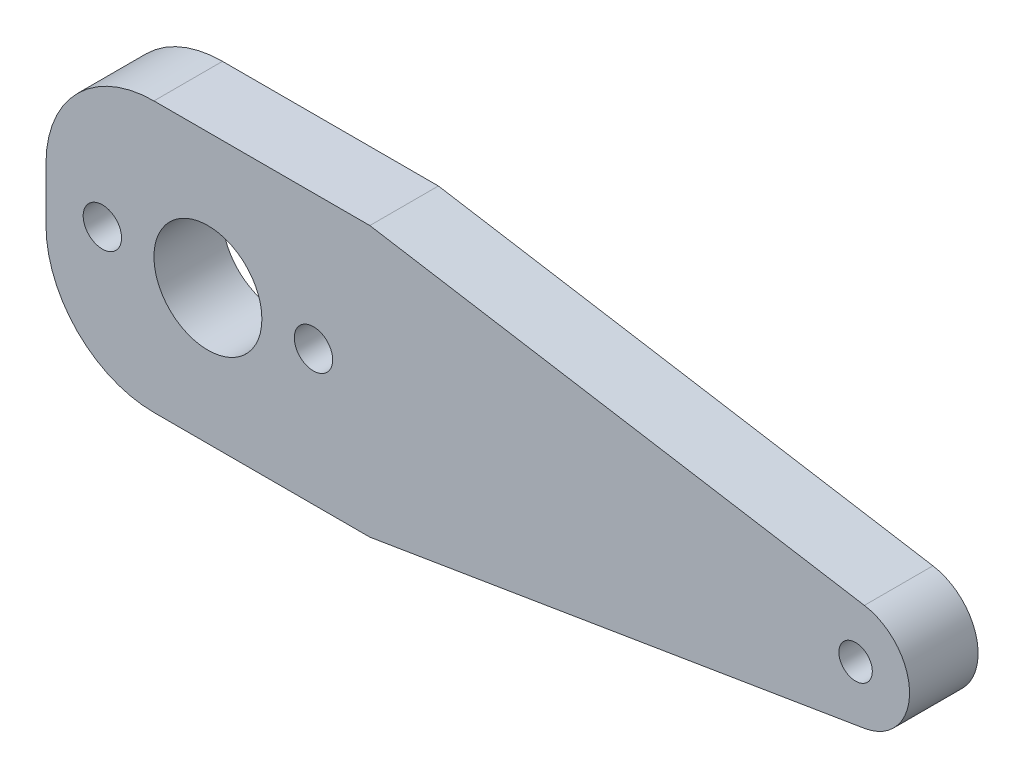
ISO-10303-21;
HEADER;
FILE_DESCRIPTION(('STEP AP214'),'2;1');
FILE_NAME('part.step','',(''),(''),'','','');
FILE_SCHEMA(('AUTOMOTIVE_DESIGN { 1 0 10303 214 1 1 1 1 }'));
ENDSEC;
DATA;
#1=APPLICATION_CONTEXT('core data for automotive mechanical design processes');
#2=APPLICATION_PROTOCOL_DEFINITION('international standard','automotive_design',2000,#1);
#3=PRODUCT_CONTEXT('',#1,'mechanical');
#4=PRODUCT('Part','Part','',(#3));
#5=PRODUCT_RELATED_PRODUCT_CATEGORY('part','',(#4));
#6=PRODUCT_DEFINITION_FORMATION('','',#4);
#7=PRODUCT_DEFINITION_CONTEXT('part definition',#1,'design');
#8=PRODUCT_DEFINITION('design','',#6,#7);
#9=PRODUCT_DEFINITION_SHAPE('','',#8);
#10=(LENGTH_UNIT() NAMED_UNIT(*) SI_UNIT(.MILLI.,.METRE.));
#11=(NAMED_UNIT(*) PLANE_ANGLE_UNIT() SI_UNIT($,.RADIAN.));
#12=(NAMED_UNIT(*) SI_UNIT($,.STERADIAN.) SOLID_ANGLE_UNIT());
#13=UNCERTAINTY_MEASURE_WITH_UNIT(LENGTH_MEASURE(1.E-05),#10,'distance_accuracy_value','');
#14=(GEOMETRIC_REPRESENTATION_CONTEXT(3) GLOBAL_UNCERTAINTY_ASSIGNED_CONTEXT((#13)) GLOBAL_UNIT_ASSIGNED_CONTEXT((#10,
#11,#12)) REPRESENTATION_CONTEXT('',''));
#15=CARTESIAN_POINT('',(0.,0.,0.));
#16=DIRECTION('',(0.,0.,1.));
#17=DIRECTION('',(1.,0.,0.));
#18=AXIS2_PLACEMENT_3D('',#15,#16,#17);
#19=CARTESIAN_POINT('',(0.796607236520986,-4.82323895389312,6.35));
#20=DIRECTION('',(-0.162952675800981,0.98663388622594,0.));
#21=DIRECTION('',(-0.98663388622594,-0.162952675800981,0.));
#22=AXIS2_PLACEMENT_3D('',#19,#20,#21);
#23=PLANE('',#22);
#24=DIRECTION('',(0.98663388622594,0.162952675800981,0.));
#25=VECTOR('',#24,1.);
#26=CARTESIAN_POINT('',(0.796607236520986,-4.82323895389312,0.));
#27=LINE('',#26,#25);
#28=CARTESIAN_POINT('',(30.,0.,0.));
#29=VERTEX_POINT('',#28);
#30=CARTESIAN_POINT('',(75.8147633790049,7.56677668182987,0.));
#31=VERTEX_POINT('',#30);
#32=EDGE_CURVE('E125',#29,#31,#27,.T.);
#33=ORIENTED_EDGE('',*,*,#32,.T.);
#34=DIRECTION('',(0.,0.,-1.));
#35=VECTOR('',#34,1.);
#36=CARTESIAN_POINT('',(75.8147633790049,7.56677668182987,6.35));
#37=LINE('',#36,#35);
#38=CARTESIAN_POINT('',(75.8147633790049,7.56677668182987,6.35));
#39=VERTEX_POINT('',#38);
#40=EDGE_CURVE('E106',#39,#31,#37,.T.);
#41=ORIENTED_EDGE('',*,*,#40,.F.);
#42=DIRECTION('',(0.98663388622594,0.162952675800981,0.));
#43=VECTOR('',#42,1.);
#44=CARTESIAN_POINT('',(0.796607236520986,-4.82323895389312,6.35));
#45=LINE('',#44,#43);
#46=CARTESIAN_POINT('',(30.,0.,6.35));
#47=VERTEX_POINT('',#46);
#48=EDGE_CURVE('E112',#47,#39,#45,.T.);
#49=ORIENTED_EDGE('',*,*,#48,.F.);
#50=DIRECTION('',(0.,0.,-1.));
#51=VECTOR('',#50,1.);
#52=CARTESIAN_POINT('',(30.,0.,6.35));
#53=LINE('',#52,#51);
#54=EDGE_CURVE('E151',#47,#29,#53,.T.);
#55=ORIENTED_EDGE('',*,*,#54,.T.);
#56=EDGE_LOOP('',(#33,#41,#49,#55));
#57=FACE_BOUND('',#56,.T.);
#58=ADVANCED_FACE('F36',(#57),#23,.F.);
#59=CARTESIAN_POINT('',(75.,12.4999461129596,6.35));
#60=DIRECTION('',(0.,0.,-1.));
#61=DIRECTION('',(-1.,0.,0.));
#62=AXIS2_PLACEMENT_3D('',#59,#60,#61);
#63=CYLINDRICAL_SURFACE('',#62,5.);
#64=CARTESIAN_POINT('',(75.,12.4999461129596,0.));
#65=DIRECTION('',(0.,0.,1.));
#66=DIRECTION('',(1.,0.,0.));
#67=AXIS2_PLACEMENT_3D('',#64,#65,#66);
#68=CIRCLE('',#67,5.);
#69=CARTESIAN_POINT('',(75.8147746755767,17.4331136783316,0.));
#70=VERTEX_POINT('',#69);
#71=EDGE_CURVE('E190',#31,#70,#68,.T.);
#72=ORIENTED_EDGE('',*,*,#71,.T.);
#73=DIRECTION('',(0.,0.,-1.));
#74=VECTOR('',#73,1.);
#75=CARTESIAN_POINT('',(75.8147746755767,17.4331136783316,6.35));
#76=LINE('',#75,#74);
#77=CARTESIAN_POINT('',(75.8147746755767,17.4331136783316,6.35));
#78=VERTEX_POINT('',#77);
#79=EDGE_CURVE('E108',#78,#70,#76,.T.);
#80=ORIENTED_EDGE('',*,*,#79,.F.);
#81=CARTESIAN_POINT('',(75.,12.4999461129596,6.35));
#82=DIRECTION('',(0.,0.,1.));
#83=DIRECTION('',(1.,0.,0.));
#84=AXIS2_PLACEMENT_3D('',#81,#82,#83);
#85=CIRCLE('',#84,5.);
#86=EDGE_CURVE('E101',#39,#78,#85,.T.);
#87=ORIENTED_EDGE('',*,*,#86,.F.);
#88=ORIENTED_EDGE('',*,*,#40,.T.);
#89=EDGE_LOOP('',(#72,#80,#87,#88));
#90=FACE_BOUND('',#89,.T.);
#91=ADVANCED_FACE('F104',(#90),#63,.T.);
#92=CARTESIAN_POINT('',(4.81604932899475,29.1594462312086,6.35));
#93=DIRECTION('',(0.162954935115337,0.986633513074412,0.));
#94=DIRECTION('',(-0.986633513074412,0.162954935115337,0.));
#95=AXIS2_PLACEMENT_3D('',#92,#93,#94);
#96=PLANE('',#95);
#97=DIRECTION('',(0.986633513074412,-0.162954935115337,0.));
#98=VECTOR('',#97,1.);
#99=CARTESIAN_POINT('',(4.81604932899475,29.1594462312086,0.));
#100=LINE('',#99,#98);
#101=CARTESIAN_POINT('',(30.,25.,0.));
#102=VERTEX_POINT('',#101);
#103=EDGE_CURVE('E169',#102,#70,#100,.T.);
#104=ORIENTED_EDGE('',*,*,#103,.F.);
#105=DIRECTION('',(0.,0.,-1.));
#106=VECTOR('',#105,1.);
#107=CARTESIAN_POINT('',(30.,25.,6.35));
#108=LINE('',#107,#106);
#109=CARTESIAN_POINT('',(30.,25.,6.35));
#110=VERTEX_POINT('',#109);
#111=EDGE_CURVE('E131',#110,#102,#108,.T.);
#112=ORIENTED_EDGE('',*,*,#111,.F.);
#113=DIRECTION('',(0.986633513074412,-0.162954935115337,0.));
#114=VECTOR('',#113,1.);
#115=CARTESIAN_POINT('',(4.81604932899475,29.1594462312086,6.35));
#116=LINE('',#115,#114);
#117=EDGE_CURVE('E111',#110,#78,#116,.T.);
#118=ORIENTED_EDGE('',*,*,#117,.T.);
#119=ORIENTED_EDGE('',*,*,#79,.T.);
#120=EDGE_LOOP('',(#104,#112,#118,#119));
#121=FACE_BOUND('',#120,.T.);
#122=ADVANCED_FACE('F189',(#121),#96,.T.);
#123=CARTESIAN_POINT('',(0.,25.,6.35));
#124=DIRECTION('',(0.,1.,0.));
#125=DIRECTION('',(0.,0.,1.));
#126=AXIS2_PLACEMENT_3D('',#123,#124,#125);
#127=PLANE('',#126);
#128=DIRECTION('',(1.,0.,0.));
#129=VECTOR('',#128,1.);
#130=CARTESIAN_POINT('',(0.,25.,0.));
#131=LINE('',#130,#129);
#132=CARTESIAN_POINT('',(10.,25.,0.));
#133=VERTEX_POINT('',#132);
#134=EDGE_CURVE('E165',#133,#102,#131,.T.);
#135=ORIENTED_EDGE('',*,*,#134,.F.);
#136=DIRECTION('',(0.,0.,-1.));
#137=VECTOR('',#136,1.);
#138=CARTESIAN_POINT('',(10.,25.,6.35));
#139=LINE('',#138,#137);
#140=CARTESIAN_POINT('',(10.,25.,6.35));
#141=VERTEX_POINT('',#140);
#142=EDGE_CURVE('E11',#133,#141,#139,.F.);
#143=ORIENTED_EDGE('',*,*,#142,.T.);
#144=DIRECTION('',(1.,0.,0.));
#145=VECTOR('',#144,1.);
#146=CARTESIAN_POINT('',(0.,25.,6.35));
#147=LINE('',#146,#145);
#148=EDGE_CURVE('E186',#141,#110,#147,.T.);
#149=ORIENTED_EDGE('',*,*,#148,.T.);
#150=ORIENTED_EDGE('',*,*,#111,.T.);
#151=EDGE_LOOP('',(#135,#143,#149,#150));
#152=FACE_BOUND('',#151,.T.);
#153=ADVANCED_FACE('F185',(#152),#127,.T.);
#154=CARTESIAN_POINT('',(0.,0.,6.35));
#155=DIRECTION('',(-1.,0.,0.));
#156=DIRECTION('',(0.,0.,1.));
#157=AXIS2_PLACEMENT_3D('',#154,#155,#156);
#158=PLANE('',#157);
#159=DIRECTION('',(0.,1.,0.));
#160=VECTOR('',#159,1.);
#161=CARTESIAN_POINT('',(0.,0.,0.));
#162=LINE('',#161,#160);
#163=CARTESIAN_POINT('',(0.,10.,0.));
#164=VERTEX_POINT('',#163);
#165=CARTESIAN_POINT('',(0.,15.,0.));
#166=VERTEX_POINT('',#165);
#167=EDGE_CURVE('E160',#164,#166,#162,.T.);
#168=ORIENTED_EDGE('',*,*,#167,.F.);
#169=DIRECTION('',(0.,0.,-1.));
#170=VECTOR('',#169,1.);
#171=CARTESIAN_POINT('',(0.,10.,6.35));
#172=LINE('',#171,#170);
#173=CARTESIAN_POINT('',(0.,10.,6.35));
#174=VERTEX_POINT('',#173);
#175=EDGE_CURVE('E141',#164,#174,#172,.F.);
#176=ORIENTED_EDGE('',*,*,#175,.T.);
#177=DIRECTION('',(0.,1.,0.));
#178=VECTOR('',#177,1.);
#179=CARTESIAN_POINT('',(0.,0.,6.35));
#180=LINE('',#179,#178);
#181=CARTESIAN_POINT('',(0.,15.,6.35));
#182=VERTEX_POINT('',#181);
#183=EDGE_CURVE('E144',#174,#182,#180,.T.);
#184=ORIENTED_EDGE('',*,*,#183,.T.);
#185=DIRECTION('',(0.,0.,-1.));
#186=VECTOR('',#185,1.);
#187=CARTESIAN_POINT('',(0.,15.,6.35));
#188=LINE('',#187,#186);
#189=EDGE_CURVE('E138',#182,#166,#188,.T.);
#190=ORIENTED_EDGE('',*,*,#189,.T.);
#191=EDGE_LOOP('',(#168,#176,#184,#190));
#192=FACE_BOUND('',#191,.T.);
#193=ADVANCED_FACE('F163',(#192),#158,.T.);
#194=CARTESIAN_POINT('',(15.,12.4999461129596,6.35));
#195=DIRECTION('',(0.,0.,-1.));
#196=DIRECTION('',(-1.,0.,0.));
#197=AXIS2_PLACEMENT_3D('',#194,#195,#196);
#198=CYLINDRICAL_SURFACE('',#197,5.);
#199=CARTESIAN_POINT('',(15.,12.4999461129596,6.35));
#200=DIRECTION('',(0.,0.,1.));
#201=DIRECTION('',(1.,0.,0.));
#202=AXIS2_PLACEMENT_3D('',#199,#200,#201);
#203=CIRCLE('',#202,5.);
#204=CARTESIAN_POINT('',(20.,12.4999461129596,6.35));
#205=VERTEX_POINT('',#204);
#206=EDGE_CURVE('E199',#205,#205,#203,.T.);
#207=ORIENTED_EDGE('',*,*,#206,.T.);
#208=EDGE_LOOP('',(#207));
#209=FACE_BOUND('',#208,.T.);
#210=CARTESIAN_POINT('',(15.,12.4999461129596,0.));
#211=DIRECTION('',(0.,0.,1.));
#212=DIRECTION('',(1.,0.,0.));
#213=AXIS2_PLACEMENT_3D('',#210,#211,#212);
#214=CIRCLE('',#213,5.);
#215=CARTESIAN_POINT('',(20.,12.4999461129596,0.));
#216=VERTEX_POINT('',#215);
#217=EDGE_CURVE('E175',#216,#216,#214,.T.);
#218=ORIENTED_EDGE('',*,*,#217,.F.);
#219=EDGE_LOOP('',(#218));
#220=FACE_BOUND('',#219,.T.);
#221=ADVANCED_FACE('F278',(#209,#220),#198,.F.);
#222=CARTESIAN_POINT('',(5.221,12.4999461129596,6.35));
#223=DIRECTION('',(0.,0.,-1.));
#224=DIRECTION('',(-1.,0.,0.));
#225=AXIS2_PLACEMENT_3D('',#222,#223,#224);
#226=CYLINDRICAL_SURFACE('',#225,1.778);
#227=CARTESIAN_POINT('',(5.221,12.4999461129596,6.35));
#228=DIRECTION('',(0.,0.,1.));
#229=DIRECTION('',(1.,0.,0.));
#230=AXIS2_PLACEMENT_3D('',#227,#228,#229);
#231=CIRCLE('',#230,1.778);
#232=CARTESIAN_POINT('',(6.999,12.4999461129596,6.35));
#233=VERTEX_POINT('',#232);
#234=EDGE_CURVE('E152',#233,#233,#231,.T.);
#235=ORIENTED_EDGE('',*,*,#234,.T.);
#236=EDGE_LOOP('',(#235));
#237=FACE_BOUND('',#236,.T.);
#238=CARTESIAN_POINT('',(5.221,12.4999461129596,0.));
#239=DIRECTION('',(0.,0.,1.));
#240=DIRECTION('',(1.,0.,0.));
#241=AXIS2_PLACEMENT_3D('',#238,#239,#240);
#242=CIRCLE('',#241,1.778);
#243=CARTESIAN_POINT('',(6.999,12.4999461129596,0.));
#244=VERTEX_POINT('',#243);
#245=EDGE_CURVE('E167',#244,#244,#242,.T.);
#246=ORIENTED_EDGE('',*,*,#245,.F.);
#247=EDGE_LOOP('',(#246));
#248=FACE_BOUND('',#247,.T.);
#249=ADVANCED_FACE('F266',(#237,#248),#226,.F.);
#250=CARTESIAN_POINT('',(0.,0.,6.35));
#251=DIRECTION('',(0.,1.,0.));
#252=DIRECTION('',(0.,0.,1.));
#253=AXIS2_PLACEMENT_3D('',#250,#251,#252);
#254=PLANE('',#253);
#255=DIRECTION('',(1.,0.,0.));
#256=VECTOR('',#255,1.);
#257=CARTESIAN_POINT('',(0.,0.,6.35));
#258=LINE('',#257,#256);
#259=CARTESIAN_POINT('',(10.,0.,6.35));
#260=VERTEX_POINT('',#259);
#261=EDGE_CURVE('E118',#260,#47,#258,.T.);
#262=ORIENTED_EDGE('',*,*,#261,.F.);
#263=DIRECTION('',(0.,0.,-1.));
#264=VECTOR('',#263,1.);
#265=CARTESIAN_POINT('',(10.,0.,0.));
#266=LINE('',#265,#264);
#267=CARTESIAN_POINT('',(10.,0.,0.));
#268=VERTEX_POINT('',#267);
#269=EDGE_CURVE('E126',#260,#268,#266,.T.);
#270=ORIENTED_EDGE('',*,*,#269,.T.);
#271=DIRECTION('',(1.,0.,0.));
#272=VECTOR('',#271,1.);
#273=CARTESIAN_POINT('',(0.,0.,0.));
#274=LINE('',#273,#272);
#275=EDGE_CURVE('E161',#268,#29,#274,.T.);
#276=ORIENTED_EDGE('',*,*,#275,.T.);
#277=ORIENTED_EDGE('',*,*,#54,.F.);
#278=EDGE_LOOP('',(#262,#270,#276,#277));
#279=FACE_BOUND('',#278,.T.);
#280=ADVANCED_FACE('F149',(#279),#254,.F.);
#281=CARTESIAN_POINT('',(24.779,12.4999461129596,6.35));
#282=DIRECTION('',(0.,0.,-1.));
#283=DIRECTION('',(-1.,0.,0.));
#284=AXIS2_PLACEMENT_3D('',#281,#282,#283);
#285=CYLINDRICAL_SURFACE('',#284,1.778);
#286=CARTESIAN_POINT('',(24.779,12.4999461129596,6.35));
#287=DIRECTION('',(0.,0.,1.));
#288=DIRECTION('',(1.,0.,0.));
#289=AXIS2_PLACEMENT_3D('',#286,#287,#288);
#290=CIRCLE('',#289,1.778);
#291=CARTESIAN_POINT('',(26.557,12.4999461129596,6.35));
#292=VERTEX_POINT('',#291);
#293=EDGE_CURVE('E122',#292,#292,#290,.T.);
#294=ORIENTED_EDGE('',*,*,#293,.T.);
#295=EDGE_LOOP('',(#294));
#296=FACE_BOUND('',#295,.T.);
#297=CARTESIAN_POINT('',(24.779,12.4999461129596,0.));
#298=DIRECTION('',(0.,0.,1.));
#299=DIRECTION('',(1.,0.,0.));
#300=AXIS2_PLACEMENT_3D('',#297,#298,#299);
#301=CIRCLE('',#300,1.778);
#302=CARTESIAN_POINT('',(26.557,12.4999461129596,0.));
#303=VERTEX_POINT('',#302);
#304=EDGE_CURVE('E194',#303,#303,#301,.T.);
#305=ORIENTED_EDGE('',*,*,#304,.F.);
#306=EDGE_LOOP('',(#305));
#307=FACE_BOUND('',#306,.T.);
#308=ADVANCED_FACE('F210',(#296,#307),#285,.F.);
#309=CARTESIAN_POINT('',(75.,12.4999461129596,6.35));
#310=DIRECTION('',(0.,0.,-1.));
#311=DIRECTION('',(-1.,0.,0.));
#312=AXIS2_PLACEMENT_3D('',#309,#310,#311);
#313=CYLINDRICAL_SURFACE('',#312,1.54999999999999);
#314=CARTESIAN_POINT('',(75.,12.4999461129596,6.35));
#315=DIRECTION('',(0.,0.,1.));
#316=DIRECTION('',(1.,0.,0.));
#317=AXIS2_PLACEMENT_3D('',#314,#315,#316);
#318=CIRCLE('',#317,1.54999999999999);
#319=CARTESIAN_POINT('',(76.55,12.4999461129596,6.35));
#320=VERTEX_POINT('',#319);
#321=EDGE_CURVE('E181',#320,#320,#318,.T.);
#322=ORIENTED_EDGE('',*,*,#321,.T.);
#323=EDGE_LOOP('',(#322));
#324=FACE_BOUND('',#323,.T.);
#325=CARTESIAN_POINT('',(75.,12.4999461129596,0.));
#326=DIRECTION('',(0.,0.,1.));
#327=DIRECTION('',(1.,0.,0.));
#328=AXIS2_PLACEMENT_3D('',#325,#326,#327);
#329=CIRCLE('',#328,1.54999999999999);
#330=CARTESIAN_POINT('',(76.55,12.4999461129596,0.));
#331=VERTEX_POINT('',#330);
#332=EDGE_CURVE('E178',#331,#331,#329,.T.);
#333=ORIENTED_EDGE('',*,*,#332,.F.);
#334=EDGE_LOOP('',(#333));
#335=FACE_BOUND('',#334,.T.);
#336=ADVANCED_FACE('F214',(#324,#335),#313,.F.);
#337=CARTESIAN_POINT('',(0.,0.,6.35));
#338=DIRECTION('',(0.,0.,1.));
#339=DIRECTION('',(1.,0.,0.));
#340=AXIS2_PLACEMENT_3D('',#337,#338,#339);
#341=PLANE('',#340);
#342=ORIENTED_EDGE('',*,*,#293,.F.);
#343=EDGE_LOOP('',(#342));
#344=FACE_BOUND('',#343,.T.);
#345=ORIENTED_EDGE('',*,*,#183,.F.);
#346=CARTESIAN_POINT('',(10.,10.,6.35));
#347=DIRECTION('',(0.,0.,1.));
#348=DIRECTION('',(1.,0.,0.));
#349=AXIS2_PLACEMENT_3D('',#346,#347,#348);
#350=CIRCLE('',#349,10.);
#351=EDGE_CURVE('E44',#174,#260,#350,.T.);
#352=ORIENTED_EDGE('',*,*,#351,.T.);
#353=ORIENTED_EDGE('',*,*,#261,.T.);
#354=ORIENTED_EDGE('',*,*,#48,.T.);
#355=ORIENTED_EDGE('',*,*,#86,.T.);
#356=ORIENTED_EDGE('',*,*,#117,.F.);
#357=ORIENTED_EDGE('',*,*,#148,.F.);
#358=CARTESIAN_POINT('',(10.,15.,6.35));
#359=DIRECTION('',(0.,0.,1.));
#360=DIRECTION('',(1.,0.,0.));
#361=AXIS2_PLACEMENT_3D('',#358,#359,#360);
#362=CIRCLE('',#361,10.);
#363=EDGE_CURVE('E56',#141,#182,#362,.T.);
#364=ORIENTED_EDGE('',*,*,#363,.T.);
#365=EDGE_LOOP('',(#345,#352,#353,#354,#355,#356,#357,#364));
#366=FACE_BOUND('',#365,.T.);
#367=ORIENTED_EDGE('',*,*,#234,.F.);
#368=EDGE_LOOP('',(#367));
#369=FACE_BOUND('',#368,.T.);
#370=ORIENTED_EDGE('',*,*,#206,.F.);
#371=EDGE_LOOP('',(#370));
#372=FACE_BOUND('',#371,.T.);
#373=ORIENTED_EDGE('',*,*,#321,.F.);
#374=EDGE_LOOP('',(#373));
#375=FACE_BOUND('',#374,.T.);
#376=ADVANCED_FACE('F115',(#344,#366,#369,#372,#375),#341,.T.);
#377=CARTESIAN_POINT('',(0.,0.,0.));
#378=DIRECTION('',(0.,0.,1.));
#379=DIRECTION('',(1.,0.,0.));
#380=AXIS2_PLACEMENT_3D('',#377,#378,#379);
#381=PLANE('',#380);
#382=ORIENTED_EDGE('',*,*,#304,.T.);
#383=EDGE_LOOP('',(#382));
#384=FACE_BOUND('',#383,.T.);
#385=ORIENTED_EDGE('',*,*,#275,.F.);
#386=CARTESIAN_POINT('',(10.,10.,0.));
#387=DIRECTION('',(0.,0.,1.));
#388=DIRECTION('',(1.,0.,0.));
#389=AXIS2_PLACEMENT_3D('',#386,#387,#388);
#390=CIRCLE('',#389,10.);
#391=EDGE_CURVE('E136',#268,#164,#390,.F.);
#392=ORIENTED_EDGE('',*,*,#391,.T.);
#393=ORIENTED_EDGE('',*,*,#167,.T.);
#394=CARTESIAN_POINT('',(10.,15.,0.));
#395=DIRECTION('',(0.,0.,1.));
#396=DIRECTION('',(1.,0.,0.));
#397=AXIS2_PLACEMENT_3D('',#394,#395,#396);
#398=CIRCLE('',#397,10.);
#399=EDGE_CURVE('E129',#166,#133,#398,.F.);
#400=ORIENTED_EDGE('',*,*,#399,.T.);
#401=ORIENTED_EDGE('',*,*,#134,.T.);
#402=ORIENTED_EDGE('',*,*,#103,.T.);
#403=ORIENTED_EDGE('',*,*,#71,.F.);
#404=ORIENTED_EDGE('',*,*,#32,.F.);
#405=EDGE_LOOP('',(#385,#392,#393,#400,#401,#402,#403,#404));
#406=FACE_BOUND('',#405,.T.);
#407=ORIENTED_EDGE('',*,*,#245,.T.);
#408=EDGE_LOOP('',(#407));
#409=FACE_BOUND('',#408,.T.);
#410=ORIENTED_EDGE('',*,*,#217,.T.);
#411=EDGE_LOOP('',(#410));
#412=FACE_BOUND('',#411,.T.);
#413=ORIENTED_EDGE('',*,*,#332,.T.);
#414=EDGE_LOOP('',(#413));
#415=FACE_BOUND('',#414,.T.);
#416=ADVANCED_FACE('F158',(#384,#406,#409,#412,#415),#381,.F.);
#417=CARTESIAN_POINT('',(10.,10.,6.35));
#418=DIRECTION('',(0.,0.,1.));
#419=DIRECTION('',(1.,0.,0.));
#420=AXIS2_PLACEMENT_3D('',#417,#418,#419);
#421=CYLINDRICAL_SURFACE('',#420,10.);
#422=ORIENTED_EDGE('',*,*,#351,.F.);
#423=ORIENTED_EDGE('',*,*,#175,.F.);
#424=ORIENTED_EDGE('',*,*,#391,.F.);
#425=ORIENTED_EDGE('',*,*,#269,.F.);
#426=EDGE_LOOP('',(#422,#423,#424,#425));
#427=FACE_BOUND('',#426,.T.);
#428=ADVANCED_FACE('F154',(#427),#421,.T.);
#429=CARTESIAN_POINT('',(10.,15.,6.35));
#430=DIRECTION('',(0.,0.,-1.));
#431=DIRECTION('',(-1.,0.,0.));
#432=AXIS2_PLACEMENT_3D('',#429,#430,#431);
#433=CYLINDRICAL_SURFACE('',#432,10.);
#434=ORIENTED_EDGE('',*,*,#363,.F.);
#435=ORIENTED_EDGE('',*,*,#142,.F.);
#436=ORIENTED_EDGE('',*,*,#399,.F.);
#437=ORIENTED_EDGE('',*,*,#189,.F.);
#438=EDGE_LOOP('',(#434,#435,#436,#437));
#439=FACE_BOUND('',#438,.T.);
#440=ADVANCED_FACE('F38',(#439),#433,.T.);
#441=CLOSED_SHELL('',(#58,#91,#122,#153,#193,#221,#249,#280,#308,#336,#376,#416,#428,#440));
#442=MANIFOLD_SOLID_BREP('B2',#441);
#443=ADVANCED_BREP_SHAPE_REPRESENTATION('',(#18,#442),#14);
#444=SHAPE_DEFINITION_REPRESENTATION(#9,#443);
ENDSEC;
END-ISO-10303-21;
